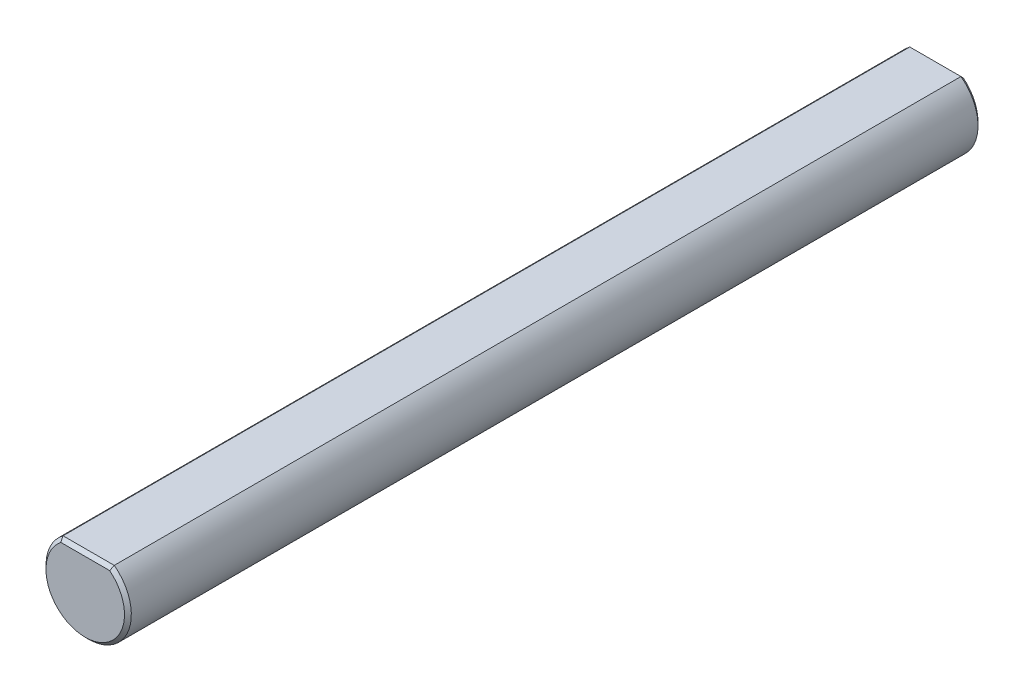
ISO-10303-21;
HEADER;
FILE_DESCRIPTION(('STEP AP214'),'2;1');
FILE_NAME('part.step','',(''),(''),'','','');
FILE_SCHEMA(('AUTOMOTIVE_DESIGN { 1 0 10303 214 1 1 1 1 }'));
ENDSEC;
DATA;
#1=APPLICATION_CONTEXT('core data for automotive mechanical design processes');
#2=APPLICATION_PROTOCOL_DEFINITION('international standard','automotive_design',2000,#1);
#3=PRODUCT_CONTEXT('',#1,'mechanical');
#4=PRODUCT('Part','Part','',(#3));
#5=PRODUCT_RELATED_PRODUCT_CATEGORY('part','',(#4));
#6=PRODUCT_DEFINITION_FORMATION('','',#4);
#7=PRODUCT_DEFINITION_CONTEXT('part definition',#1,'design');
#8=PRODUCT_DEFINITION('design','',#6,#7);
#9=PRODUCT_DEFINITION_SHAPE('','',#8);
#10=(LENGTH_UNIT() NAMED_UNIT(*) SI_UNIT(.MILLI.,.METRE.));
#11=(NAMED_UNIT(*) PLANE_ANGLE_UNIT() SI_UNIT($,.RADIAN.));
#12=(NAMED_UNIT(*) SI_UNIT($,.STERADIAN.) SOLID_ANGLE_UNIT());
#13=UNCERTAINTY_MEASURE_WITH_UNIT(LENGTH_MEASURE(1.E-05),#10,'distance_accuracy_value','');
#14=(GEOMETRIC_REPRESENTATION_CONTEXT(3) GLOBAL_UNCERTAINTY_ASSIGNED_CONTEXT((#13)) GLOBAL_UNIT_ASSIGNED_CONTEXT((#10,
#11,#12)) REPRESENTATION_CONTEXT('',''));
#15=CARTESIAN_POINT('',(0.,0.,0.));
#16=DIRECTION('',(0.,0.,1.));
#17=DIRECTION('',(1.,0.,0.));
#18=AXIS2_PLACEMENT_3D('',#15,#16,#17);
#19=CARTESIAN_POINT('',(0.,0.,25.));
#20=DIRECTION('',(0.,0.,-1.));
#21=DIRECTION('',(-1.,0.,0.));
#22=AXIS2_PLACEMENT_3D('',#19,#20,#21);
#23=CYLINDRICAL_SURFACE('',#22,2.5);
#24=DIRECTION('',(0.,0.,-1.));
#25=VECTOR('',#24,1.);
#26=CARTESIAN_POINT('',(1.5,2.,25.));
#27=LINE('',#26,#25);
#28=CARTESIAN_POINT('',(1.5,2.,24.8));
#29=VERTEX_POINT('',#28);
#30=CARTESIAN_POINT('',(1.5,2.,-24.8));
#31=VERTEX_POINT('',#30);
#32=EDGE_CURVE('E89',#29,#31,#27,.T.);
#33=ORIENTED_EDGE('',*,*,#32,.F.);
#34=CARTESIAN_POINT('',(0.,0.,24.8));
#35=DIRECTION('',(0.,0.,1.));
#36=DIRECTION('',(1.,0.,0.));
#37=AXIS2_PLACEMENT_3D('',#34,#35,#36);
#38=CIRCLE('',#37,2.5);
#39=CARTESIAN_POINT('',(-1.5,2.,24.8));
#40=VERTEX_POINT('',#39);
#41=EDGE_CURVE('E85',#29,#40,#38,.F.);
#42=ORIENTED_EDGE('',*,*,#41,.T.);
#43=DIRECTION('',(0.,0.,-1.));
#44=VECTOR('',#43,1.);
#45=CARTESIAN_POINT('',(-1.5,2.,25.));
#46=LINE('',#45,#44);
#47=CARTESIAN_POINT('',(-1.5,2.,-24.8));
#48=VERTEX_POINT('',#47);
#49=EDGE_CURVE('E87',#40,#48,#46,.T.);
#50=ORIENTED_EDGE('',*,*,#49,.T.);
#51=CARTESIAN_POINT('',(0.,0.,-24.8));
#52=DIRECTION('',(0.,0.,1.));
#53=DIRECTION('',(1.,0.,0.));
#54=AXIS2_PLACEMENT_3D('',#51,#52,#53);
#55=CIRCLE('',#54,2.5);
#56=EDGE_CURVE('E94',#48,#31,#55,.T.);
#57=ORIENTED_EDGE('',*,*,#56,.T.);
#58=EDGE_LOOP('',(#33,#42,#50,#57));
#59=FACE_BOUND('',#58,.T.);
#60=ADVANCED_FACE('F36',(#59),#23,.T.);
#61=CARTESIAN_POINT('',(0.,2.,25.));
#62=DIRECTION('',(0.,1.,0.));
#63=DIRECTION('',(0.,0.,1.));
#64=AXIS2_PLACEMENT_3D('',#61,#62,#63);
#65=PLANE('',#64);
#66=ORIENTED_EDGE('',*,*,#49,.F.);
#67=DIRECTION('',(1.,0.,0.));
#68=VECTOR('',#67,1.);
#69=CARTESIAN_POINT('',(0.,2.,24.8));
#70=LINE('',#69,#68);
#71=EDGE_CURVE('E100',#40,#29,#70,.T.);
#72=ORIENTED_EDGE('',*,*,#71,.T.);
#73=ORIENTED_EDGE('',*,*,#32,.T.);
#74=DIRECTION('',(-1.,0.,0.));
#75=VECTOR('',#74,1.);
#76=CARTESIAN_POINT('',(-1.5,2.,-24.8));
#77=LINE('',#76,#75);
#78=EDGE_CURVE('E101',#31,#48,#77,.T.);
#79=ORIENTED_EDGE('',*,*,#78,.T.);
#80=EDGE_LOOP('',(#66,#72,#73,#79));
#81=FACE_BOUND('',#80,.T.);
#82=ADVANCED_FACE('F98',(#81),#65,.T.);
#83=CARTESIAN_POINT('',(0.,0.,25.));
#84=DIRECTION('',(0.,0.,1.));
#85=DIRECTION('',(1.,0.,0.));
#86=AXIS2_PLACEMENT_3D('',#83,#84,#85);
#87=PLANE('',#86);
#88=CARTESIAN_POINT('',(0.,0.,25.));
#89=DIRECTION('',(0.,0.,1.));
#90=DIRECTION('',(1.,0.,0.));
#91=AXIS2_PLACEMENT_3D('',#88,#89,#90);
#92=CIRCLE('',#91,2.3);
#93=CARTESIAN_POINT('',(-1.43178210632767,1.79999999999997,25.));
#94=VERTEX_POINT('',#93);
#95=CARTESIAN_POINT('',(1.43178210632767,1.79999999999997,25.));
#96=VERTEX_POINT('',#95);
#97=EDGE_CURVE('E106',#94,#96,#92,.T.);
#98=ORIENTED_EDGE('',*,*,#97,.T.);
#99=DIRECTION('',(-1.,0.,0.));
#100=VECTOR('',#99,1.);
#101=CARTESIAN_POINT('',(0.,1.8,25.));
#102=LINE('',#101,#100);
#103=EDGE_CURVE('E114',#96,#94,#102,.T.);
#104=ORIENTED_EDGE('',*,*,#103,.T.);
#105=EDGE_LOOP('',(#98,#104));
#106=FACE_BOUND('',#105,.T.);
#107=ADVANCED_FACE('F149',(#106),#87,.T.);
#108=CARTESIAN_POINT('',(0.,0.,-25.));
#109=DIRECTION('',(0.,0.,1.));
#110=DIRECTION('',(1.,0.,0.));
#111=AXIS2_PLACEMENT_3D('',#108,#109,#110);
#112=PLANE('',#111);
#113=CARTESIAN_POINT('',(0.,0.,-25.));
#114=DIRECTION('',(0.,0.,1.));
#115=DIRECTION('',(1.,0.,0.));
#116=AXIS2_PLACEMENT_3D('',#113,#114,#115);
#117=CIRCLE('',#116,2.3);
#118=CARTESIAN_POINT('',(1.43178210632767,1.79999999999997,-25.));
#119=VERTEX_POINT('',#118);
#120=CARTESIAN_POINT('',(-1.43178210632767,1.79999999999997,-25.));
#121=VERTEX_POINT('',#120);
#122=EDGE_CURVE('E50',#119,#121,#117,.F.);
#123=ORIENTED_EDGE('',*,*,#122,.T.);
#124=DIRECTION('',(1.,0.,0.));
#125=VECTOR('',#124,1.);
#126=CARTESIAN_POINT('',(1.5,1.8,-25.));
#127=LINE('',#126,#125);
#128=EDGE_CURVE('E11',#121,#119,#127,.T.);
#129=ORIENTED_EDGE('',*,*,#128,.T.);
#130=EDGE_LOOP('',(#123,#129));
#131=FACE_BOUND('',#130,.T.);
#132=ADVANCED_FACE('F147',(#131),#112,.F.);
#133=CARTESIAN_POINT('',(0.,0.,25.));
#134=DIRECTION('',(0.,0.,-1.));
#135=DIRECTION('',(-1.,0.,0.));
#136=AXIS2_PLACEMENT_3D('',#133,#134,#135);
#137=CONICAL_SURFACE('',#136,2.3,0.785398163397453);
#138=CARTESIAN_POINT('',(1.5,2.,24.8));
#139=CARTESIAN_POINT('',(1.4888803343446,1.96662404366757,24.8333759563324));
#140=CARTESIAN_POINT('',(1.47763567874643,1.93326940371163,24.8667305962884));
#141=CARTESIAN_POINT('',(1.45489638100215,1.86660273701998,24.93339726298));
#142=CARTESIAN_POINT('',(1.44340173870956,1.83329071030925,24.9667092896907));
#143=CARTESIAN_POINT('',(1.43178210632772,1.8,25.));
#144=B_SPLINE_CURVE_WITH_KNOTS('',3,(#138,#139,#140,#141,#142,#143),.UNSPECIFIED.,.F.,.F.,(4,2,
4),(0.,0.145476996925001,0.290954079097025),.UNSPECIFIED.);
#145=EDGE_CURVE('E110',#96,#29,#144,.F.);
#146=ORIENTED_EDGE('',*,*,#145,.F.);
#147=ORIENTED_EDGE('',*,*,#97,.F.);
#148=CARTESIAN_POINT('',(-1.43178210632769,1.8,25.));
#149=CARTESIAN_POINT('',(-1.44340173870953,1.83329071030926,24.9667092896907));
#150=CARTESIAN_POINT('',(-1.45489638100213,1.86660273701999,24.93339726298));
#151=CARTESIAN_POINT('',(-1.47763567874645,1.93326940371163,24.8667305962884));
#152=CARTESIAN_POINT('',(-1.48888033434465,1.96662404366756,24.8333759563324));
#153=CARTESIAN_POINT('',(-1.5000000000001,1.99999999999998,24.8));
#154=B_SPLINE_CURVE_WITH_KNOTS('',3,(#148,#149,#150,#151,#152,#153),.UNSPECIFIED.,.F.,.F.,(4,2,
4),(0.,0.145477082172023,0.290954079097024),.UNSPECIFIED.);
#155=EDGE_CURVE('E102',#40,#94,#154,.F.);
#156=ORIENTED_EDGE('',*,*,#155,.F.);
#157=ORIENTED_EDGE('',*,*,#41,.F.);
#158=EDGE_LOOP('',(#146,#147,#156,#157));
#159=FACE_BOUND('',#158,.T.);
#160=ADVANCED_FACE('F105',(#159),#137,.T.);
#161=CARTESIAN_POINT('',(0.,2.,24.8));
#162=DIRECTION('',(0.,-0.707106781186544,-0.707106781186551));
#163=DIRECTION('',(1.,0.,0.));
#164=AXIS2_PLACEMENT_3D('',#161,#162,#163);
#165=PLANE('',#164);
#166=ORIENTED_EDGE('',*,*,#155,.T.);
#167=ORIENTED_EDGE('',*,*,#103,.F.);
#168=ORIENTED_EDGE('',*,*,#145,.T.);
#169=ORIENTED_EDGE('',*,*,#71,.F.);
#170=EDGE_LOOP('',(#166,#167,#168,#169));
#171=FACE_BOUND('',#170,.T.);
#172=ADVANCED_FACE('F112',(#171),#165,.F.);
#173=CARTESIAN_POINT('',(0.,0.,-24.8));
#174=DIRECTION('',(0.,0.,1.));
#175=DIRECTION('',(1.,0.,0.));
#176=AXIS2_PLACEMENT_3D('',#173,#174,#175);
#177=CONICAL_SURFACE('',#176,2.5,0.785398163397444);
#178=CARTESIAN_POINT('',(1.43178210632769,1.8,-25.));
#179=CARTESIAN_POINT('',(1.44340173870953,1.83329071030925,-24.9667092896907));
#180=CARTESIAN_POINT('',(1.45489638100213,1.86660273701998,-24.93339726298));
#181=CARTESIAN_POINT('',(1.47763567874645,1.93326940371163,-24.8667305962884));
#182=CARTESIAN_POINT('',(1.48888033434465,1.96662404366756,-24.8333759563324));
#183=CARTESIAN_POINT('',(1.5000000000001,1.99999999999998,-24.8));
#184=B_SPLINE_CURVE_WITH_KNOTS('',3,(#178,#179,#180,#181,#182,#183),.UNSPECIFIED.,.F.,.F.,(4,2,
4),(0.,0.145477082172031,0.290954079097037),.UNSPECIFIED.);
#185=EDGE_CURVE('E63',#31,#119,#184,.F.);
#186=ORIENTED_EDGE('',*,*,#185,.F.);
#187=ORIENTED_EDGE('',*,*,#56,.F.);
#188=CARTESIAN_POINT('',(-1.5,2.,-24.8));
#189=CARTESIAN_POINT('',(-1.4888803343446,1.96662404366757,-24.8333759563324));
#190=CARTESIAN_POINT('',(-1.47763567874643,1.93326940371163,-24.8667305962884));
#191=CARTESIAN_POINT('',(-1.45489638100215,1.86660273701998,-24.93339726298));
#192=CARTESIAN_POINT('',(-1.44340173870956,1.83329071030925,-24.9667092896907));
#193=CARTESIAN_POINT('',(-1.43178210632772,1.79999999999999,-25.));
#194=B_SPLINE_CURVE_WITH_KNOTS('',3,(#188,#189,#190,#191,#192,#193),.UNSPECIFIED.,.F.,.F.,(4,2,
4),(0.,0.145476996925007,0.290954079097037),.UNSPECIFIED.);
#195=EDGE_CURVE('E41',#121,#48,#194,.F.);
#196=ORIENTED_EDGE('',*,*,#195,.F.);
#197=ORIENTED_EDGE('',*,*,#122,.F.);
#198=EDGE_LOOP('',(#186,#187,#196,#197));
#199=FACE_BOUND('',#198,.T.);
#200=ADVANCED_FACE('F136',(#199),#177,.T.);
#201=CARTESIAN_POINT('',(0.,1.8,-25.));
#202=DIRECTION('',(0.,0.707106781186551,-0.707106781186544));
#203=DIRECTION('',(-1.,0.,0.));
#204=AXIS2_PLACEMENT_3D('',#201,#202,#203);
#205=PLANE('',#204);
#206=ORIENTED_EDGE('',*,*,#195,.T.);
#207=ORIENTED_EDGE('',*,*,#78,.F.);
#208=ORIENTED_EDGE('',*,*,#185,.T.);
#209=ORIENTED_EDGE('',*,*,#128,.F.);
#210=EDGE_LOOP('',(#206,#207,#208,#209));
#211=FACE_BOUND('',#210,.T.);
#212=ADVANCED_FACE('F38',(#211),#205,.T.);
#213=CLOSED_SHELL('',(#60,#82,#107,#132,#160,#172,#200,#212));
#214=MANIFOLD_SOLID_BREP('B2',#213);
#215=ADVANCED_BREP_SHAPE_REPRESENTATION('',(#18,#214),#14);
#216=SHAPE_DEFINITION_REPRESENTATION(#9,#215);
ENDSEC;
END-ISO-10303-21;
